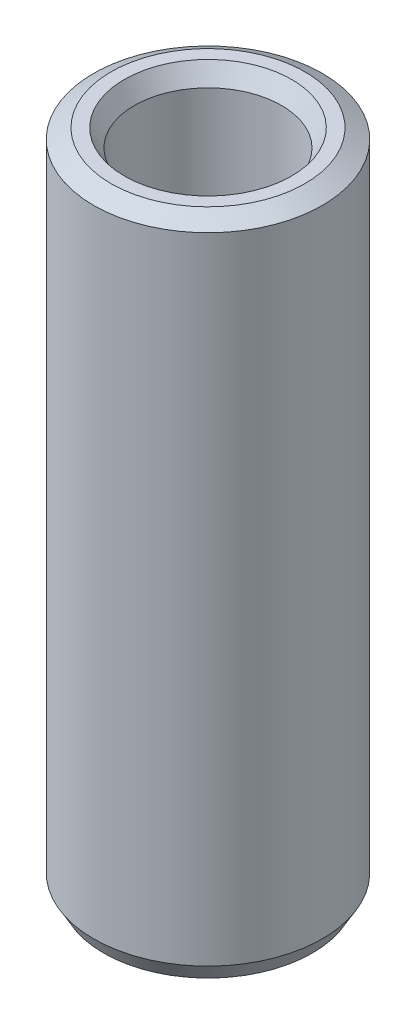
ISO-10303-21;
HEADER;
FILE_DESCRIPTION(('STEP AP214'),'2;1');
FILE_NAME('part.step','',(''),(''),'','','');
FILE_SCHEMA(('AUTOMOTIVE_DESIGN { 1 0 10303 214 1 1 1 1 }'));
ENDSEC;
DATA;
#1=APPLICATION_CONTEXT('core data for automotive mechanical design processes');
#2=APPLICATION_PROTOCOL_DEFINITION('international standard','automotive_design',2000,#1);
#3=PRODUCT_CONTEXT('',#1,'mechanical');
#4=PRODUCT('Part','Part','',(#3));
#5=PRODUCT_RELATED_PRODUCT_CATEGORY('part','',(#4));
#6=PRODUCT_DEFINITION_FORMATION('','',#4);
#7=PRODUCT_DEFINITION_CONTEXT('part definition',#1,'design');
#8=PRODUCT_DEFINITION('design','',#6,#7);
#9=PRODUCT_DEFINITION_SHAPE('','',#8);
#10=(LENGTH_UNIT() NAMED_UNIT(*) SI_UNIT(.MILLI.,.METRE.));
#11=(NAMED_UNIT(*) PLANE_ANGLE_UNIT() SI_UNIT($,.RADIAN.));
#12=(NAMED_UNIT(*) SI_UNIT($,.STERADIAN.) SOLID_ANGLE_UNIT());
#13=UNCERTAINTY_MEASURE_WITH_UNIT(LENGTH_MEASURE(1.E-05),#10,'distance_accuracy_value','');
#14=(GEOMETRIC_REPRESENTATION_CONTEXT(3) GLOBAL_UNCERTAINTY_ASSIGNED_CONTEXT((#13)) GLOBAL_UNIT_ASSIGNED_CONTEXT((#10,
#11,#12)) REPRESENTATION_CONTEXT('',''));
#15=CARTESIAN_POINT('',(0.,0.,0.));
#16=DIRECTION('',(0.,0.,1.));
#17=DIRECTION('',(1.,0.,0.));
#18=AXIS2_PLACEMENT_3D('',#15,#16,#17);
#19=CARTESIAN_POINT('',(0.,260.693337735297,0.));
#20=DIRECTION('',(0.,-1.,0.));
#21=DIRECTION('',(0.,0.,-1.));
#22=AXIS2_PLACEMENT_3D('',#19,#20,#21);
#23=CYLINDRICAL_SURFACE('',#22,45.);
#24=CARTESIAN_POINT('',(0.,6.87174431805099,0.));
#25=DIRECTION('',(0.,1.,0.));
#26=DIRECTION('',(0.,0.,1.));
#27=AXIS2_PLACEMENT_3D('',#24,#25,#26);
#28=CIRCLE('',#27,45.);
#29=CARTESIAN_POINT('',(0.,6.87174431805099,45.));
#30=VERTEX_POINT('',#29);
#31=EDGE_CURVE('E10',#30,#30,#28,.T.);
#32=ORIENTED_EDGE('',*,*,#31,.T.);
#33=EDGE_LOOP('',(#32));
#34=FACE_BOUND('',#33,.T.);
#35=CARTESIAN_POINT('',(0.,256.725934303468,0.));
#36=DIRECTION('',(0.,1.,0.));
#37=DIRECTION('',(0.,0.,1.));
#38=AXIS2_PLACEMENT_3D('',#35,#36,#37);
#39=CIRCLE('',#38,45.);
#40=CARTESIAN_POINT('',(0.,256.725934303468,45.));
#41=VERTEX_POINT('',#40);
#42=EDGE_CURVE('E50',#41,#41,#39,.F.);
#43=ORIENTED_EDGE('',*,*,#42,.T.);
#44=EDGE_LOOP('',(#43));
#45=FACE_BOUND('',#44,.T.);
#46=ADVANCED_FACE('F39',(#34,#45),#23,.T.);
#47=CARTESIAN_POINT('',(0.,260.693337735297,0.));
#48=DIRECTION('',(0.,1.,0.));
#49=DIRECTION('',(0.,0.,1.));
#50=AXIS2_PLACEMENT_3D('',#47,#48,#49);
#51=PLANE('',#50);
#52=CARTESIAN_POINT('',(0.,260.693337735297,0.));
#53=DIRECTION('',(0.,1.,0.));
#54=DIRECTION('',(0.,0.,1.));
#55=AXIS2_PLACEMENT_3D('',#52,#53,#54);
#56=CIRCLE('',#55,32.9135637876809);
#57=CARTESIAN_POINT('',(0.,260.693337735297,32.9135637876809));
#58=VERTEX_POINT('',#57);
#59=EDGE_CURVE('E58',#58,#58,#56,.F.);
#60=ORIENTED_EDGE('',*,*,#59,.T.);
#61=EDGE_LOOP('',(#60));
#62=FACE_BOUND('',#61,.T.);
#63=CARTESIAN_POINT('',(0.,260.693337735297,0.));
#64=DIRECTION('',(0.,1.,0.));
#65=DIRECTION('',(0.,0.,1.));
#66=AXIS2_PLACEMENT_3D('',#63,#64,#65);
#67=CIRCLE('',#66,38.1282556819492);
#68=CARTESIAN_POINT('',(0.,260.693337735297,38.1282556819492));
#69=VERTEX_POINT('',#68);
#70=EDGE_CURVE('E61',#69,#69,#67,.T.);
#71=ORIENTED_EDGE('',*,*,#70,.T.);
#72=EDGE_LOOP('',(#71));
#73=FACE_BOUND('',#72,.T.);
#74=ADVANCED_FACE('F88',(#62,#73),#51,.T.);
#75=CARTESIAN_POINT('',(0.,0.,0.));
#76=DIRECTION('',(0.,1.,0.));
#77=DIRECTION('',(0.,0.,1.));
#78=AXIS2_PLACEMENT_3D('',#75,#76,#77);
#79=PLANE('',#78);
#80=CARTESIAN_POINT('',(0.,0.,0.));
#81=DIRECTION('',(0.,1.,0.));
#82=DIRECTION('',(0.,0.,1.));
#83=AXIS2_PLACEMENT_3D('',#80,#81,#82);
#84=CIRCLE('',#83,35.8179046739029);
#85=CARTESIAN_POINT('',(0.,0.,35.8179046739029));
#86=VERTEX_POINT('',#85);
#87=EDGE_CURVE('E51',#86,#86,#84,.T.);
#88=ORIENTED_EDGE('',*,*,#87,.T.);
#89=EDGE_LOOP('',(#88));
#90=FACE_BOUND('',#89,.T.);
#91=CARTESIAN_POINT('',(0.,0.,0.));
#92=DIRECTION('',(0.,1.,0.));
#93=DIRECTION('',(0.,0.,1.));
#94=AXIS2_PLACEMENT_3D('',#91,#92,#93);
#95=CIRCLE('',#94,41.032596568171);
#96=CARTESIAN_POINT('',(0.,0.,41.032596568171));
#97=VERTEX_POINT('',#96);
#98=EDGE_CURVE('E54',#97,#97,#95,.F.);
#99=ORIENTED_EDGE('',*,*,#98,.T.);
#100=EDGE_LOOP('',(#99));
#101=FACE_BOUND('',#100,.T.);
#102=ADVANCED_FACE('F83',(#90,#101),#79,.F.);
#103=CARTESIAN_POINT('',(0.,260.693337735297,0.));
#104=DIRECTION('',(0.,-1.,0.));
#105=DIRECTION('',(0.,0.,-1.));
#106=AXIS2_PLACEMENT_3D('',#103,#104,#105);
#107=CYLINDRICAL_SURFACE('',#106,28.946160355852);
#108=CARTESIAN_POINT('',(0.,253.821593417246,0.));
#109=DIRECTION('',(0.,1.,0.));
#110=DIRECTION('',(0.,0.,1.));
#111=AXIS2_PLACEMENT_3D('',#108,#109,#110);
#112=CIRCLE('',#111,28.946160355852);
#113=CARTESIAN_POINT('',(0.,253.821593417246,28.946160355852));
#114=VERTEX_POINT('',#113);
#115=EDGE_CURVE('E67',#114,#114,#112,.T.);
#116=ORIENTED_EDGE('',*,*,#115,.T.);
#117=EDGE_LOOP('',(#116));
#118=FACE_BOUND('',#117,.T.);
#119=CARTESIAN_POINT('',(0.,3.96740343182905,0.));
#120=DIRECTION('',(0.,1.,0.));
#121=DIRECTION('',(0.,0.,1.));
#122=AXIS2_PLACEMENT_3D('',#119,#120,#121);
#123=CIRCLE('',#122,28.946160355852);
#124=CARTESIAN_POINT('',(0.,3.96740343182905,28.946160355852));
#125=VERTEX_POINT('',#124);
#126=EDGE_CURVE('E69',#125,#125,#123,.F.);
#127=ORIENTED_EDGE('',*,*,#126,.T.);
#128=EDGE_LOOP('',(#127));
#129=FACE_BOUND('',#128,.T.);
#130=ADVANCED_FACE('F71',(#118,#129),#107,.F.);
#131=CARTESIAN_POINT('',(0.,253.821593417246,0.));
#132=DIRECTION('',(0.,1.,0.));
#133=DIRECTION('',(0.,0.,1.));
#134=AXIS2_PLACEMENT_3D('',#131,#132,#133);
#135=CONICAL_SURFACE('',#134,28.946160355852,0.523598775598298);
#136=ORIENTED_EDGE('',*,*,#59,.F.);
#137=EDGE_LOOP('',(#136));
#138=FACE_BOUND('',#137,.T.);
#139=ORIENTED_EDGE('',*,*,#115,.F.);
#140=EDGE_LOOP('',(#139));
#141=FACE_BOUND('',#140,.T.);
#142=ADVANCED_FACE('F77',(#138,#141),#135,.F.);
#143=CARTESIAN_POINT('',(0.,0.,0.));
#144=DIRECTION('',(0.,-1.,0.));
#145=DIRECTION('',(0.,0.,-1.));
#146=AXIS2_PLACEMENT_3D('',#143,#144,#145);
#147=CONICAL_SURFACE('',#146,35.8179046739029,1.04719755119659);
#148=ORIENTED_EDGE('',*,*,#126,.F.);
#149=EDGE_LOOP('',(#148));
#150=FACE_BOUND('',#149,.T.);
#151=ORIENTED_EDGE('',*,*,#87,.F.);
#152=EDGE_LOOP('',(#151));
#153=FACE_BOUND('',#152,.T.);
#154=ADVANCED_FACE('F73',(#150,#153),#147,.F.);
#155=CARTESIAN_POINT('',(0.,6.87174431805099,0.));
#156=DIRECTION('',(0.,1.,0.));
#157=DIRECTION('',(0.,0.,1.));
#158=AXIS2_PLACEMENT_3D('',#155,#156,#157);
#159=CONICAL_SURFACE('',#158,45.,0.5235987755983);
#160=ORIENTED_EDGE('',*,*,#98,.F.);
#161=EDGE_LOOP('',(#160));
#162=FACE_BOUND('',#161,.T.);
#163=ORIENTED_EDGE('',*,*,#31,.F.);
#164=EDGE_LOOP('',(#163));
#165=FACE_BOUND('',#164,.T.);
#166=ADVANCED_FACE('F76',(#162,#165),#159,.T.);
#167=CARTESIAN_POINT('',(0.,260.693337735297,0.));
#168=DIRECTION('',(0.,-1.,0.));
#169=DIRECTION('',(0.,0.,-1.));
#170=AXIS2_PLACEMENT_3D('',#167,#168,#169);
#171=CONICAL_SURFACE('',#170,38.1282556819492,1.04719755119659);
#172=ORIENTED_EDGE('',*,*,#42,.F.);
#173=EDGE_LOOP('',(#172));
#174=FACE_BOUND('',#173,.T.);
#175=ORIENTED_EDGE('',*,*,#70,.F.);
#176=EDGE_LOOP('',(#175));
#177=FACE_BOUND('',#176,.T.);
#178=ADVANCED_FACE('F45',(#174,#177),#171,.T.);
#179=CLOSED_SHELL('',(#46,#74,#102,#130,#142,#154,#166,#178));
#180=MANIFOLD_SOLID_BREP('B2',#179);
#181=ADVANCED_BREP_SHAPE_REPRESENTATION('',(#18,#180),#14);
#182=SHAPE_DEFINITION_REPRESENTATION(#9,#181);
ENDSEC;
END-ISO-10303-21;
